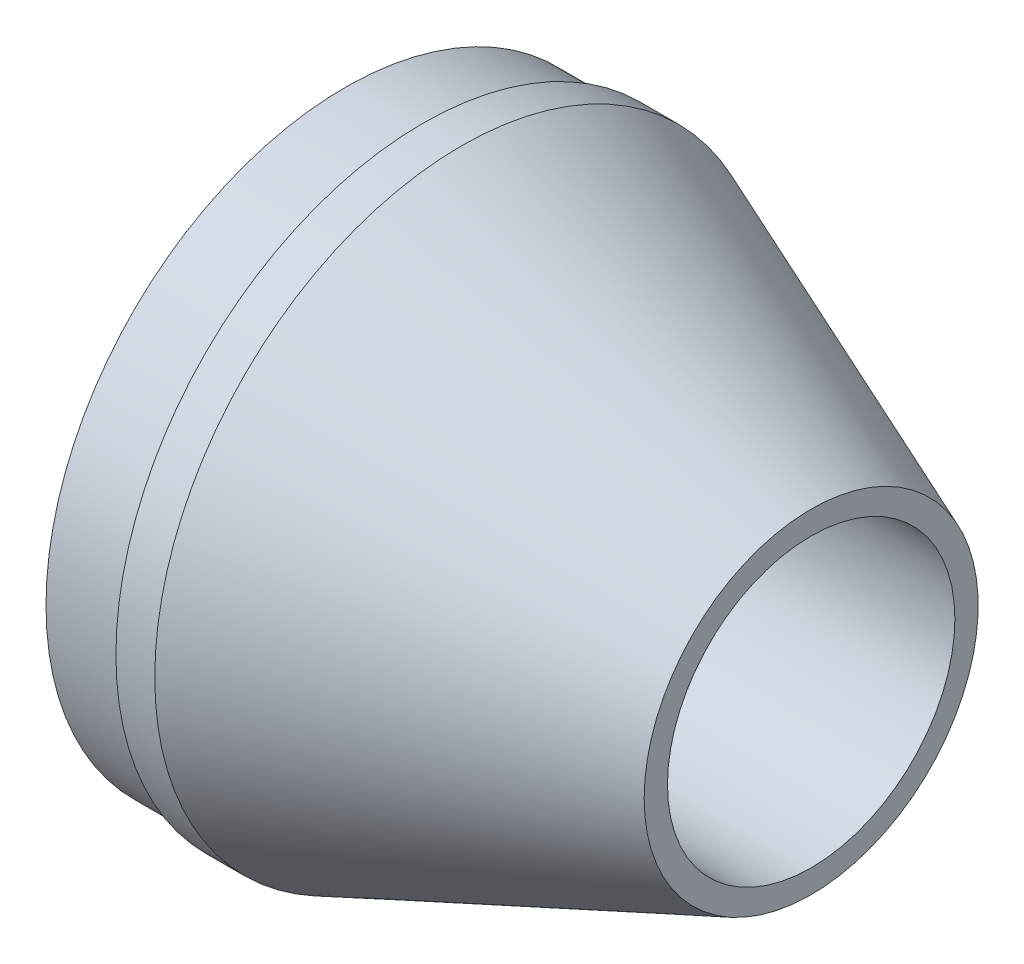
ISO-10303-21;
HEADER;
FILE_DESCRIPTION(('STEP AP214'),'2;1');
FILE_NAME('part.step','',(''),(''),'','','');
FILE_SCHEMA(('AUTOMOTIVE_DESIGN { 1 0 10303 214 1 1 1 1 }'));
ENDSEC;
DATA;
#1=APPLICATION_CONTEXT('core data for automotive mechanical design processes');
#2=APPLICATION_PROTOCOL_DEFINITION('international standard','automotive_design',2000,#1);
#3=PRODUCT_CONTEXT('',#1,'mechanical');
#4=PRODUCT('Part','Part','',(#3));
#5=PRODUCT_RELATED_PRODUCT_CATEGORY('part','',(#4));
#6=PRODUCT_DEFINITION_FORMATION('','',#4);
#7=PRODUCT_DEFINITION_CONTEXT('part definition',#1,'design');
#8=PRODUCT_DEFINITION('design','',#6,#7);
#9=PRODUCT_DEFINITION_SHAPE('','',#8);
#10=(LENGTH_UNIT() NAMED_UNIT(*) SI_UNIT(.MILLI.,.METRE.));
#11=(NAMED_UNIT(*) PLANE_ANGLE_UNIT() SI_UNIT($,.RADIAN.));
#12=(NAMED_UNIT(*) SI_UNIT($,.STERADIAN.) SOLID_ANGLE_UNIT());
#13=UNCERTAINTY_MEASURE_WITH_UNIT(LENGTH_MEASURE(1.E-05),#10,'distance_accuracy_value','');
#14=(GEOMETRIC_REPRESENTATION_CONTEXT(3) GLOBAL_UNCERTAINTY_ASSIGNED_CONTEXT((#13)) GLOBAL_UNIT_ASSIGNED_CONTEXT((#10,
#11,#12)) REPRESENTATION_CONTEXT('',''));
#15=CARTESIAN_POINT('',(0.,0.,0.));
#16=DIRECTION('',(0.,0.,1.));
#17=DIRECTION('',(1.,0.,0.));
#18=AXIS2_PLACEMENT_3D('',#15,#16,#17);
#19=CARTESIAN_POINT('',(-28.5657586709258,7.21368135942009,0.));
#20=DIRECTION('',(1.,0.,0.));
#21=DIRECTION('',(0.,0.,-1.));
#22=AXIS2_PLACEMENT_3D('',#19,#20,#21);
#23=PLANE('',#22);
#24=CARTESIAN_POINT('',(-28.5657586709258,-13.2863186405799,0.));
#25=DIRECTION('',(-1.,0.,0.));
#26=DIRECTION('',(0.,0.,1.));
#27=AXIS2_PLACEMENT_3D('',#24,#25,#26);
#28=CIRCLE('',#27,20.5);
#29=CARTESIAN_POINT('',(-28.5657586709258,-13.2863186405799,20.5));
#30=VERTEX_POINT('',#29);
#31=EDGE_CURVE('E60',#30,#30,#28,.T.);
#32=ORIENTED_EDGE('',*,*,#31,.F.);
#33=EDGE_LOOP('',(#32));
#34=FACE_BOUND('',#33,.T.);
#35=CARTESIAN_POINT('',(-28.5657586709258,-13.2863186405799,0.));
#36=DIRECTION('',(-1.,0.,0.));
#37=DIRECTION('',(0.,0.,1.));
#38=AXIS2_PLACEMENT_3D('',#35,#36,#37);
#39=CIRCLE('',#38,38.5);
#40=CARTESIAN_POINT('',(-28.5657586709258,-13.2863186405799,38.5));
#41=VERTEX_POINT('',#40);
#42=EDGE_CURVE('E10',#41,#41,#39,.T.);
#43=ORIENTED_EDGE('',*,*,#42,.T.);
#44=EDGE_LOOP('',(#43));
#45=FACE_BOUND('',#44,.T.);
#46=ADVANCED_FACE('F29',(#34,#45),#23,.F.);
#47=CARTESIAN_POINT('',(-43.5457796044276,-13.2863186405799,0.));
#48=DIRECTION('',(-1.,0.,0.));
#49=DIRECTION('',(0.,0.,1.));
#50=AXIS2_PLACEMENT_3D('',#47,#48,#49);
#51=CYLINDRICAL_SURFACE('',#50,38.5);
#52=ORIENTED_EDGE('',*,*,#42,.F.);
#53=EDGE_LOOP('',(#52));
#54=FACE_BOUND('',#53,.T.);
#55=CARTESIAN_POINT('',(-18.5657586709258,-13.2863186405799,0.));
#56=DIRECTION('',(-1.,0.,0.));
#57=DIRECTION('',(0.,0.,1.));
#58=AXIS2_PLACEMENT_3D('',#55,#56,#57);
#59=CIRCLE('',#58,38.5);
#60=CARTESIAN_POINT('',(-18.5657586709258,-13.2863186405799,38.5));
#61=VERTEX_POINT('',#60);
#62=EDGE_CURVE('E35',#61,#61,#59,.T.);
#63=ORIENTED_EDGE('',*,*,#62,.T.);
#64=EDGE_LOOP('',(#63));
#65=FACE_BOUND('',#64,.T.);
#66=ADVANCED_FACE('F67',(#54,#65),#51,.T.);
#67=CARTESIAN_POINT('',(-18.5657586709258,25.2136813594201,0.));
#68=DIRECTION('',(1.,0.,0.));
#69=DIRECTION('',(0.,0.,-1.));
#70=AXIS2_PLACEMENT_3D('',#67,#68,#69);
#71=PLANE('',#70);
#72=ORIENTED_EDGE('',*,*,#62,.F.);
#73=EDGE_LOOP('',(#72));
#74=FACE_BOUND('',#73,.T.);
#75=CARTESIAN_POINT('',(-18.5657586709258,-13.2863186405799,0.));
#76=DIRECTION('',(-1.,0.,0.));
#77=DIRECTION('',(0.,0.,1.));
#78=AXIS2_PLACEMENT_3D('',#75,#76,#77);
#79=CIRCLE('',#78,39.5);
#80=CARTESIAN_POINT('',(-18.5657586709258,-13.2863186405799,39.5));
#81=VERTEX_POINT('',#80);
#82=EDGE_CURVE('E39',#81,#81,#79,.T.);
#83=ORIENTED_EDGE('',*,*,#82,.T.);
#84=EDGE_LOOP('',(#83));
#85=FACE_BOUND('',#84,.T.);
#86=ADVANCED_FACE('F71',(#74,#85),#71,.F.);
#87=CARTESIAN_POINT('',(-43.5457796044276,-13.2863186405799,0.));
#88=DIRECTION('',(-1.,0.,0.));
#89=DIRECTION('',(0.,0.,1.));
#90=AXIS2_PLACEMENT_3D('',#87,#88,#89);
#91=CYLINDRICAL_SURFACE('',#90,39.5);
#92=ORIENTED_EDGE('',*,*,#82,.F.);
#93=EDGE_LOOP('',(#92));
#94=FACE_BOUND('',#93,.T.);
#95=CARTESIAN_POINT('',(-13.5657586709258,-13.2863186405799,0.));
#96=DIRECTION('',(-1.,0.,0.));
#97=DIRECTION('',(0.,0.,1.));
#98=AXIS2_PLACEMENT_3D('',#95,#96,#97);
#99=CIRCLE('',#98,39.5);
#100=CARTESIAN_POINT('',(-13.5657586709258,-13.2863186405799,39.5));
#101=VERTEX_POINT('',#100);
#102=EDGE_CURVE('E43',#101,#101,#99,.T.);
#103=ORIENTED_EDGE('',*,*,#102,.T.);
#104=EDGE_LOOP('',(#103));
#105=FACE_BOUND('',#104,.T.);
#106=ADVANCED_FACE('F76',(#94,#105),#91,.T.);
#107=CARTESIAN_POINT('',(31.4342413290742,-13.2863186405799,0.));
#108=DIRECTION('',(-1.,0.,0.));
#109=DIRECTION('',(0.,0.,1.));
#110=AXIS2_PLACEMENT_3D('',#107,#108,#109);
#111=CONICAL_SURFACE('',#110,21.5,0.380506377112365);
#112=ORIENTED_EDGE('',*,*,#102,.F.);
#113=EDGE_LOOP('',(#112));
#114=FACE_BOUND('',#113,.T.);
#115=CARTESIAN_POINT('',(31.4342413290742,-13.2863186405799,0.));
#116=DIRECTION('',(-1.,0.,0.));
#117=DIRECTION('',(0.,0.,1.));
#118=AXIS2_PLACEMENT_3D('',#115,#116,#117);
#119=CIRCLE('',#118,21.5);
#120=CARTESIAN_POINT('',(31.4342413290742,-13.2863186405799,21.5));
#121=VERTEX_POINT('',#120);
#122=EDGE_CURVE('E48',#121,#121,#119,.T.);
#123=ORIENTED_EDGE('',*,*,#122,.T.);
#124=EDGE_LOOP('',(#123));
#125=FACE_BOUND('',#124,.T.);
#126=ADVANCED_FACE('F82',(#114,#125),#111,.T.);
#127=CARTESIAN_POINT('',(31.4342413290742,5.21368135942009,0.));
#128=DIRECTION('',(-1.,0.,0.));
#129=DIRECTION('',(0.,0.,1.));
#130=AXIS2_PLACEMENT_3D('',#127,#128,#129);
#131=PLANE('',#130);
#132=ORIENTED_EDGE('',*,*,#122,.F.);
#133=EDGE_LOOP('',(#132));
#134=FACE_BOUND('',#133,.T.);
#135=CARTESIAN_POINT('',(31.4342413290742,-13.2863186405799,0.));
#136=DIRECTION('',(-1.,0.,0.));
#137=DIRECTION('',(0.,0.,1.));
#138=AXIS2_PLACEMENT_3D('',#135,#136,#137);
#139=CIRCLE('',#138,18.5);
#140=CARTESIAN_POINT('',(31.4342413290742,-13.2863186405799,18.5));
#141=VERTEX_POINT('',#140);
#142=EDGE_CURVE('E51',#141,#141,#139,.T.);
#143=ORIENTED_EDGE('',*,*,#142,.T.);
#144=EDGE_LOOP('',(#143));
#145=FACE_BOUND('',#144,.T.);
#146=ADVANCED_FACE('F86',(#134,#145),#131,.F.);
#147=CARTESIAN_POINT('',(-43.5457796044276,-13.2863186405799,0.));
#148=DIRECTION('',(-1.,0.,0.));
#149=DIRECTION('',(0.,0.,1.));
#150=AXIS2_PLACEMENT_3D('',#147,#148,#149);
#151=CYLINDRICAL_SURFACE('',#150,18.5);
#152=ORIENTED_EDGE('',*,*,#142,.F.);
#153=EDGE_LOOP('',(#152));
#154=FACE_BOUND('',#153,.T.);
#155=CARTESIAN_POINT('',(-15.5657586709258,-13.2863186405799,0.));
#156=DIRECTION('',(-1.,0.,0.));
#157=DIRECTION('',(0.,0.,1.));
#158=AXIS2_PLACEMENT_3D('',#155,#156,#157);
#159=CIRCLE('',#158,18.5);
#160=CARTESIAN_POINT('',(-15.5657586709258,-13.2863186405799,18.5));
#161=VERTEX_POINT('',#160);
#162=EDGE_CURVE('E54',#161,#161,#159,.T.);
#163=ORIENTED_EDGE('',*,*,#162,.T.);
#164=EDGE_LOOP('',(#163));
#165=FACE_BOUND('',#164,.T.);
#166=ADVANCED_FACE('F90',(#154,#165),#151,.F.);
#167=CARTESIAN_POINT('',(-15.5657586709258,5.21368135942009,0.));
#168=DIRECTION('',(1.,0.,0.));
#169=DIRECTION('',(0.,0.,-1.));
#170=AXIS2_PLACEMENT_3D('',#167,#168,#169);
#171=PLANE('',#170);
#172=ORIENTED_EDGE('',*,*,#162,.F.);
#173=EDGE_LOOP('',(#172));
#174=FACE_BOUND('',#173,.T.);
#175=CARTESIAN_POINT('',(-15.5657586709258,-13.2863186405799,0.));
#176=DIRECTION('',(-1.,0.,0.));
#177=DIRECTION('',(0.,0.,1.));
#178=AXIS2_PLACEMENT_3D('',#175,#176,#177);
#179=CIRCLE('',#178,20.5);
#180=CARTESIAN_POINT('',(-15.5657586709258,-13.2863186405799,20.5));
#181=VERTEX_POINT('',#180);
#182=EDGE_CURVE('E57',#181,#181,#179,.T.);
#183=ORIENTED_EDGE('',*,*,#182,.T.);
#184=EDGE_LOOP('',(#183));
#185=FACE_BOUND('',#184,.T.);
#186=ADVANCED_FACE('F94',(#174,#185),#171,.F.);
#187=CARTESIAN_POINT('',(-43.5457796044276,-13.2863186405799,0.));
#188=DIRECTION('',(-1.,0.,0.));
#189=DIRECTION('',(0.,0.,1.));
#190=AXIS2_PLACEMENT_3D('',#187,#188,#189);
#191=CYLINDRICAL_SURFACE('',#190,20.5);
#192=ORIENTED_EDGE('',*,*,#182,.F.);
#193=EDGE_LOOP('',(#192));
#194=FACE_BOUND('',#193,.T.);
#195=ORIENTED_EDGE('',*,*,#31,.T.);
#196=EDGE_LOOP('',(#195));
#197=FACE_BOUND('',#196,.T.);
#198=ADVANCED_FACE('F64',(#194,#197),#191,.F.);
#199=CLOSED_SHELL('',(#46,#66,#86,#106,#126,#146,#166,#186,#198));
#200=MANIFOLD_SOLID_BREP('B2',#199);
#201=ADVANCED_BREP_SHAPE_REPRESENTATION('',(#18,#200),#14);
#202=SHAPE_DEFINITION_REPRESENTATION(#9,#201);
ENDSEC;
END-ISO-10303-21;
